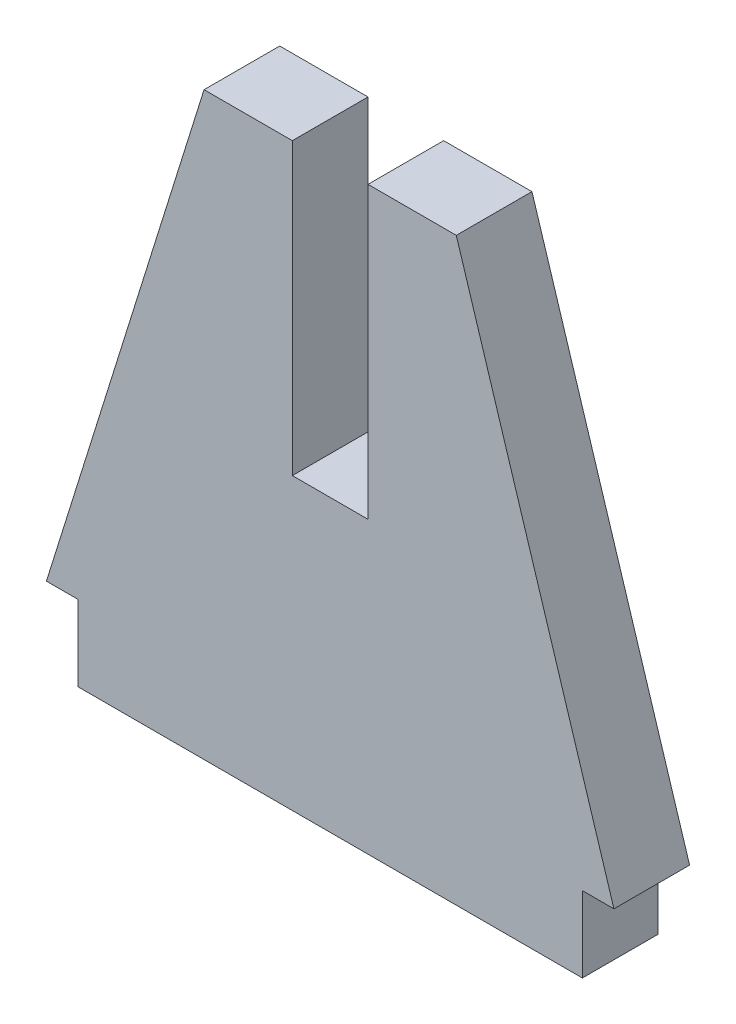
ISO-10303-21;
HEADER;
FILE_DESCRIPTION(('STEP AP214'),'2;1');
FILE_NAME('part.step','',(''),(''),'','','');
FILE_SCHEMA(('AUTOMOTIVE_DESIGN { 1 0 10303 214 1 1 1 1 }'));
ENDSEC;
DATA;
#1=APPLICATION_CONTEXT('core data for automotive mechanical design processes');
#2=APPLICATION_PROTOCOL_DEFINITION('international standard','automotive_design',2000,#1);
#3=PRODUCT_CONTEXT('',#1,'mechanical');
#4=PRODUCT('Part','Part','',(#3));
#5=PRODUCT_RELATED_PRODUCT_CATEGORY('part','',(#4));
#6=PRODUCT_DEFINITION_FORMATION('','',#4);
#7=PRODUCT_DEFINITION_CONTEXT('part definition',#1,'design');
#8=PRODUCT_DEFINITION('design','',#6,#7);
#9=PRODUCT_DEFINITION_SHAPE('','',#8);
#10=(LENGTH_UNIT() NAMED_UNIT(*) SI_UNIT(.MILLI.,.METRE.));
#11=(NAMED_UNIT(*) PLANE_ANGLE_UNIT() SI_UNIT($,.RADIAN.));
#12=(NAMED_UNIT(*) SI_UNIT($,.STERADIAN.) SOLID_ANGLE_UNIT());
#13=UNCERTAINTY_MEASURE_WITH_UNIT(LENGTH_MEASURE(1.E-05),#10,'distance_accuracy_value','');
#14=(GEOMETRIC_REPRESENTATION_CONTEXT(3) GLOBAL_UNCERTAINTY_ASSIGNED_CONTEXT((#13)) GLOBAL_UNIT_ASSIGNED_CONTEXT((#10,
#11,#12)) REPRESENTATION_CONTEXT('',''));
#15=CARTESIAN_POINT('',(0.,0.,0.));
#16=DIRECTION('',(0.,0.,1.));
#17=DIRECTION('',(1.,0.,0.));
#18=AXIS2_PLACEMENT_3D('',#15,#16,#17);
#19=CARTESIAN_POINT('',(10.,46.,3.));
#20=DIRECTION('',(0.,-1.,0.));
#21=DIRECTION('',(0.,0.,-1.));
#22=AXIS2_PLACEMENT_3D('',#19,#20,#21);
#23=PLANE('',#22);
#24=DIRECTION('',(-1.,0.,0.));
#25=VECTOR('',#24,1.);
#26=CARTESIAN_POINT('',(10.,46.,3.));
#27=LINE('',#26,#25);
#28=CARTESIAN_POINT('',(-3.,46.,3.));
#29=VERTEX_POINT('',#28);
#30=CARTESIAN_POINT('',(-10.,46.,3.));
#31=VERTEX_POINT('',#30);
#32=EDGE_CURVE('E214',#29,#31,#27,.T.);
#33=ORIENTED_EDGE('',*,*,#32,.F.);
#34=DIRECTION('',(0.,0.,1.));
#35=VECTOR('',#34,1.);
#36=CARTESIAN_POINT('',(-3.,46.,-3.));
#37=LINE('',#36,#35);
#38=CARTESIAN_POINT('',(-3.,46.,-3.));
#39=VERTEX_POINT('',#38);
#40=EDGE_CURVE('E144',#39,#29,#37,.T.);
#41=ORIENTED_EDGE('',*,*,#40,.F.);
#42=DIRECTION('',(-1.,0.,0.));
#43=VECTOR('',#42,1.);
#44=CARTESIAN_POINT('',(10.,46.,-3.));
#45=LINE('',#44,#43);
#46=CARTESIAN_POINT('',(-10.,46.,-3.));
#47=VERTEX_POINT('',#46);
#48=EDGE_CURVE('E148',#39,#47,#45,.T.);
#49=ORIENTED_EDGE('',*,*,#48,.T.);
#50=DIRECTION('',(0.,0.,-1.));
#51=VECTOR('',#50,1.);
#52=CARTESIAN_POINT('',(-10.,46.,3.));
#53=LINE('',#52,#51);
#54=EDGE_CURVE('E162',#31,#47,#53,.T.);
#55=ORIENTED_EDGE('',*,*,#54,.F.);
#56=EDGE_LOOP('',(#33,#41,#49,#55));
#57=FACE_BOUND('',#56,.T.);
#58=ADVANCED_FACE('F30',(#57),#23,.F.);
#59=CARTESIAN_POINT('',(20.,0.,3.));
#60=DIRECTION('',(-1.,0.,0.));
#61=DIRECTION('',(0.,-1.,0.));
#62=AXIS2_PLACEMENT_3D('',#59,#60,#61);
#63=PLANE('',#62);
#64=DIRECTION('',(0.,1.,0.));
#65=VECTOR('',#64,1.);
#66=CARTESIAN_POINT('',(20.,0.,-3.));
#67=LINE('',#66,#65);
#68=CARTESIAN_POINT('',(20.,0.,-3.));
#69=VERTEX_POINT('',#68);
#70=CARTESIAN_POINT('',(20.,6.00000000000001,-3.));
#71=VERTEX_POINT('',#70);
#72=EDGE_CURVE('E140',#69,#71,#67,.T.);
#73=ORIENTED_EDGE('',*,*,#72,.T.);
#74=DIRECTION('',(0.,0.,-1.));
#75=VECTOR('',#74,1.);
#76=CARTESIAN_POINT('',(20.,6.00000000000001,3.));
#77=LINE('',#76,#75);
#78=CARTESIAN_POINT('',(20.,6.00000000000001,3.));
#79=VERTEX_POINT('',#78);
#80=EDGE_CURVE('E11',#79,#71,#77,.T.);
#81=ORIENTED_EDGE('',*,*,#80,.F.);
#82=DIRECTION('',(0.,1.,0.));
#83=VECTOR('',#82,1.);
#84=CARTESIAN_POINT('',(20.,0.,3.));
#85=LINE('',#84,#83);
#86=CARTESIAN_POINT('',(20.,0.,3.));
#87=VERTEX_POINT('',#86);
#88=EDGE_CURVE('E158',#87,#79,#85,.T.);
#89=ORIENTED_EDGE('',*,*,#88,.F.);
#90=DIRECTION('',(0.,0.,-1.));
#91=VECTOR('',#90,1.);
#92=CARTESIAN_POINT('',(20.,0.,3.));
#93=LINE('',#92,#91);
#94=EDGE_CURVE('E136',#87,#69,#93,.T.);
#95=ORIENTED_EDGE('',*,*,#94,.T.);
#96=EDGE_LOOP('',(#73,#81,#89,#95));
#97=FACE_BOUND('',#96,.T.);
#98=ADVANCED_FACE('F32',(#97),#63,.F.);
#99=CARTESIAN_POINT('',(22.5,6.,3.));
#100=DIRECTION('',(0.,1.,0.));
#101=DIRECTION('',(-1.,0.,0.));
#102=AXIS2_PLACEMENT_3D('',#99,#100,#101);
#103=PLANE('',#102);
#104=DIRECTION('',(1.,0.,0.));
#105=VECTOR('',#104,1.);
#106=CARTESIAN_POINT('',(22.5,6.,-3.));
#107=LINE('',#106,#105);
#108=CARTESIAN_POINT('',(22.5,6.,-3.));
#109=VERTEX_POINT('',#108);
#110=EDGE_CURVE('E143',#71,#109,#107,.T.);
#111=ORIENTED_EDGE('',*,*,#110,.T.);
#112=DIRECTION('',(0.,0.,-1.));
#113=VECTOR('',#112,1.);
#114=CARTESIAN_POINT('',(22.5,6.,3.));
#115=LINE('',#114,#113);
#116=CARTESIAN_POINT('',(22.5,6.,3.));
#117=VERTEX_POINT('',#116);
#118=EDGE_CURVE('E38',#117,#109,#115,.T.);
#119=ORIENTED_EDGE('',*,*,#118,.F.);
#120=DIRECTION('',(1.,0.,0.));
#121=VECTOR('',#120,1.);
#122=CARTESIAN_POINT('',(22.5,6.,3.));
#123=LINE('',#122,#121);
#124=EDGE_CURVE('E95',#79,#117,#123,.T.);
#125=ORIENTED_EDGE('',*,*,#124,.F.);
#126=ORIENTED_EDGE('',*,*,#80,.T.);
#127=EDGE_LOOP('',(#111,#119,#125,#126));
#128=FACE_BOUND('',#127,.T.);
#129=ADVANCED_FACE('F243',(#128),#103,.F.);
#130=CARTESIAN_POINT('',(10.,46.,3.));
#131=DIRECTION('',(-0.95447997803503,-0.298274993135947,0.));
#132=DIRECTION('',(0.298274993135947,-0.95447997803503,0.));
#133=AXIS2_PLACEMENT_3D('',#130,#131,#132);
#134=PLANE('',#133);
#135=DIRECTION('',(-0.298274993135947,0.95447997803503,0.));
#136=VECTOR('',#135,1.);
#137=CARTESIAN_POINT('',(10.,46.,-3.));
#138=LINE('',#137,#136);
#139=CARTESIAN_POINT('',(10.,46.,-3.));
#140=VERTEX_POINT('',#139);
#141=EDGE_CURVE('E146',#109,#140,#138,.T.);
#142=ORIENTED_EDGE('',*,*,#141,.T.);
#143=DIRECTION('',(0.,0.,-1.));
#144=VECTOR('',#143,1.);
#145=CARTESIAN_POINT('',(10.,46.,3.));
#146=LINE('',#145,#144);
#147=CARTESIAN_POINT('',(10.,46.,3.));
#148=VERTEX_POINT('',#147);
#149=EDGE_CURVE('E165',#148,#140,#146,.T.);
#150=ORIENTED_EDGE('',*,*,#149,.F.);
#151=DIRECTION('',(-0.298274993135947,0.95447997803503,0.));
#152=VECTOR('',#151,1.);
#153=CARTESIAN_POINT('',(10.,46.,3.));
#154=LINE('',#153,#152);
#155=EDGE_CURVE('E173',#117,#148,#154,.T.);
#156=ORIENTED_EDGE('',*,*,#155,.F.);
#157=ORIENTED_EDGE('',*,*,#118,.T.);
#158=EDGE_LOOP('',(#142,#150,#156,#157));
#159=FACE_BOUND('',#158,.T.);
#160=ADVANCED_FACE('F171',(#159),#134,.F.);
#161=CARTESIAN_POINT('',(3.,46.,-3.));
#162=VERTEX_POINT('',#161);
#163=EDGE_CURVE('E149',#140,#162,#45,.T.);
#164=ORIENTED_EDGE('',*,*,#163,.T.);
#165=DIRECTION('',(0.,0.,1.));
#166=VECTOR('',#165,1.);
#167=CARTESIAN_POINT('',(3.,46.,-3.));
#168=LINE('',#167,#166);
#169=CARTESIAN_POINT('',(3.,46.,3.));
#170=VERTEX_POINT('',#169);
#171=EDGE_CURVE('E186',#162,#170,#168,.T.);
#172=ORIENTED_EDGE('',*,*,#171,.T.);
#173=EDGE_CURVE('E219',#148,#170,#27,.T.);
#174=ORIENTED_EDGE('',*,*,#173,.F.);
#175=ORIENTED_EDGE('',*,*,#149,.T.);
#176=EDGE_LOOP('',(#164,#172,#174,#175));
#177=FACE_BOUND('',#176,.T.);
#178=ADVANCED_FACE('F183',(#177),#23,.F.);
#179=CARTESIAN_POINT('',(-10.,46.,3.));
#180=DIRECTION('',(0.95447997803503,-0.298274993135947,0.));
#181=DIRECTION('',(0.298274993135947,0.95447997803503,0.));
#182=AXIS2_PLACEMENT_3D('',#179,#180,#181);
#183=PLANE('',#182);
#184=DIRECTION('',(-0.298274993135947,-0.95447997803503,0.));
#185=VECTOR('',#184,1.);
#186=CARTESIAN_POINT('',(-10.,46.,-3.));
#187=LINE('',#186,#185);
#188=CARTESIAN_POINT('',(-22.5,6.,-3.));
#189=VERTEX_POINT('',#188);
#190=EDGE_CURVE('E152',#47,#189,#187,.T.);
#191=ORIENTED_EDGE('',*,*,#190,.T.);
#192=DIRECTION('',(0.,0.,-1.));
#193=VECTOR('',#192,1.);
#194=CARTESIAN_POINT('',(-22.5,6.,3.));
#195=LINE('',#194,#193);
#196=CARTESIAN_POINT('',(-22.5,6.,3.));
#197=VERTEX_POINT('',#196);
#198=EDGE_CURVE('E131',#197,#189,#195,.T.);
#199=ORIENTED_EDGE('',*,*,#198,.F.);
#200=DIRECTION('',(-0.298274993135947,-0.95447997803503,0.));
#201=VECTOR('',#200,1.);
#202=CARTESIAN_POINT('',(-10.,46.,3.));
#203=LINE('',#202,#201);
#204=EDGE_CURVE('E119',#31,#197,#203,.T.);
#205=ORIENTED_EDGE('',*,*,#204,.F.);
#206=ORIENTED_EDGE('',*,*,#54,.T.);
#207=EDGE_LOOP('',(#191,#199,#205,#206));
#208=FACE_BOUND('',#207,.T.);
#209=ADVANCED_FACE('F238',(#208),#183,.F.);
#210=CARTESIAN_POINT('',(-22.5,6.,3.));
#211=DIRECTION('',(0.,1.,0.));
#212=DIRECTION('',(-1.,0.,0.));
#213=AXIS2_PLACEMENT_3D('',#210,#211,#212);
#214=PLANE('',#213);
#215=DIRECTION('',(1.,0.,0.));
#216=VECTOR('',#215,1.);
#217=CARTESIAN_POINT('',(-22.5,6.,-3.));
#218=LINE('',#217,#216);
#219=CARTESIAN_POINT('',(-20.,6.,-3.));
#220=VERTEX_POINT('',#219);
#221=EDGE_CURVE('E128',#189,#220,#218,.T.);
#222=ORIENTED_EDGE('',*,*,#221,.T.);
#223=DIRECTION('',(0.,0.,-1.));
#224=VECTOR('',#223,1.);
#225=CARTESIAN_POINT('',(-20.,6.,3.));
#226=LINE('',#225,#224);
#227=CARTESIAN_POINT('',(-20.,6.,3.));
#228=VERTEX_POINT('',#227);
#229=EDGE_CURVE('E125',#228,#220,#226,.T.);
#230=ORIENTED_EDGE('',*,*,#229,.F.);
#231=DIRECTION('',(1.,0.,0.));
#232=VECTOR('',#231,1.);
#233=CARTESIAN_POINT('',(-22.5,6.,3.));
#234=LINE('',#233,#232);
#235=EDGE_CURVE('E111',#197,#228,#234,.T.);
#236=ORIENTED_EDGE('',*,*,#235,.F.);
#237=ORIENTED_EDGE('',*,*,#198,.T.);
#238=EDGE_LOOP('',(#222,#230,#236,#237));
#239=FACE_BOUND('',#238,.T.);
#240=ADVANCED_FACE('F126',(#239),#214,.F.);
#241=CARTESIAN_POINT('',(-20.,6.,3.));
#242=DIRECTION('',(1.,0.,0.));
#243=DIRECTION('',(0.,1.,0.));
#244=AXIS2_PLACEMENT_3D('',#241,#242,#243);
#245=PLANE('',#244);
#246=DIRECTION('',(0.,-1.,0.));
#247=VECTOR('',#246,1.);
#248=CARTESIAN_POINT('',(-20.,6.,-3.));
#249=LINE('',#248,#247);
#250=CARTESIAN_POINT('',(-20.,0.,-3.));
#251=VERTEX_POINT('',#250);
#252=EDGE_CURVE('E155',#220,#251,#249,.T.);
#253=ORIENTED_EDGE('',*,*,#252,.T.);
#254=DIRECTION('',(0.,0.,-1.));
#255=VECTOR('',#254,1.);
#256=CARTESIAN_POINT('',(-20.,0.,3.));
#257=LINE('',#256,#255);
#258=CARTESIAN_POINT('',(-20.,0.,3.));
#259=VERTEX_POINT('',#258);
#260=EDGE_CURVE('E132',#259,#251,#257,.T.);
#261=ORIENTED_EDGE('',*,*,#260,.F.);
#262=DIRECTION('',(0.,-1.,0.));
#263=VECTOR('',#262,1.);
#264=CARTESIAN_POINT('',(-20.,6.,3.));
#265=LINE('',#264,#263);
#266=EDGE_CURVE('E116',#228,#259,#265,.T.);
#267=ORIENTED_EDGE('',*,*,#266,.F.);
#268=ORIENTED_EDGE('',*,*,#229,.T.);
#269=EDGE_LOOP('',(#253,#261,#267,#268));
#270=FACE_BOUND('',#269,.T.);
#271=ADVANCED_FACE('F134',(#270),#245,.F.);
#272=CARTESIAN_POINT('',(-20.,0.,3.));
#273=DIRECTION('',(0.,1.,0.));
#274=DIRECTION('',(-1.,0.,0.));
#275=AXIS2_PLACEMENT_3D('',#272,#273,#274);
#276=PLANE('',#275);
#277=DIRECTION('',(1.,0.,0.));
#278=VECTOR('',#277,1.);
#279=CARTESIAN_POINT('',(-20.,0.,-3.));
#280=LINE('',#279,#278);
#281=EDGE_CURVE('E87',#251,#69,#280,.T.);
#282=ORIENTED_EDGE('',*,*,#281,.T.);
#283=ORIENTED_EDGE('',*,*,#94,.F.);
#284=DIRECTION('',(1.,0.,0.));
#285=VECTOR('',#284,1.);
#286=CARTESIAN_POINT('',(-20.,0.,3.));
#287=LINE('',#286,#285);
#288=EDGE_CURVE('E54',#259,#87,#287,.T.);
#289=ORIENTED_EDGE('',*,*,#288,.F.);
#290=ORIENTED_EDGE('',*,*,#260,.T.);
#291=EDGE_LOOP('',(#282,#283,#289,#290));
#292=FACE_BOUND('',#291,.T.);
#293=ADVANCED_FACE('F239',(#292),#276,.F.);
#294=CARTESIAN_POINT('',(20.,6.00000000000001,3.));
#295=DIRECTION('',(0.,0.,1.));
#296=DIRECTION('',(1.,0.,0.));
#297=AXIS2_PLACEMENT_3D('',#294,#295,#296);
#298=PLANE('',#297);
#299=DIRECTION('',(0.,-1.,0.));
#300=VECTOR('',#299,1.);
#301=CARTESIAN_POINT('',(-3.,46.,3.));
#302=LINE('',#301,#300);
#303=CARTESIAN_POINT('',(-3.,23.,3.));
#304=VERTEX_POINT('',#303);
#305=EDGE_CURVE('E207',#29,#304,#302,.T.);
#306=ORIENTED_EDGE('',*,*,#305,.F.);
#307=ORIENTED_EDGE('',*,*,#32,.T.);
#308=ORIENTED_EDGE('',*,*,#204,.T.);
#309=ORIENTED_EDGE('',*,*,#235,.T.);
#310=ORIENTED_EDGE('',*,*,#266,.T.);
#311=ORIENTED_EDGE('',*,*,#288,.T.);
#312=ORIENTED_EDGE('',*,*,#88,.T.);
#313=ORIENTED_EDGE('',*,*,#124,.T.);
#314=ORIENTED_EDGE('',*,*,#155,.T.);
#315=ORIENTED_EDGE('',*,*,#173,.T.);
#316=DIRECTION('',(0.,1.,0.));
#317=VECTOR('',#316,1.);
#318=CARTESIAN_POINT('',(3.,46.,3.));
#319=LINE('',#318,#317);
#320=CARTESIAN_POINT('',(3.,23.,3.));
#321=VERTEX_POINT('',#320);
#322=EDGE_CURVE('E201',#321,#170,#319,.T.);
#323=ORIENTED_EDGE('',*,*,#322,.F.);
#324=DIRECTION('',(1.,0.,0.));
#325=VECTOR('',#324,1.);
#326=CARTESIAN_POINT('',(-3.,23.,3.));
#327=LINE('',#326,#325);
#328=EDGE_CURVE('E217',#304,#321,#327,.T.);
#329=ORIENTED_EDGE('',*,*,#328,.F.);
#330=EDGE_LOOP('',(#306,#307,#308,#309,#310,#311,#312,#313,#314,#315,#323,#329));
#331=FACE_BOUND('',#330,.T.);
#332=ADVANCED_FACE('F114',(#331),#298,.T.);
#333=CARTESIAN_POINT('',(20.,6.00000000000001,-3.));
#334=DIRECTION('',(0.,0.,1.));
#335=DIRECTION('',(1.,0.,0.));
#336=AXIS2_PLACEMENT_3D('',#333,#334,#335);
#337=PLANE('',#336);
#338=ORIENTED_EDGE('',*,*,#48,.F.);
#339=DIRECTION('',(0.,-1.,0.));
#340=VECTOR('',#339,1.);
#341=CARTESIAN_POINT('',(-3.,46.,-3.));
#342=LINE('',#341,#340);
#343=CARTESIAN_POINT('',(-3.,23.,-3.));
#344=VERTEX_POINT('',#343);
#345=EDGE_CURVE('E210',#39,#344,#342,.T.);
#346=ORIENTED_EDGE('',*,*,#345,.T.);
#347=DIRECTION('',(1.,0.,0.));
#348=VECTOR('',#347,1.);
#349=CARTESIAN_POINT('',(-3.,23.,-3.));
#350=LINE('',#349,#348);
#351=CARTESIAN_POINT('',(3.,23.,-3.));
#352=VERTEX_POINT('',#351);
#353=EDGE_CURVE('E233',#344,#352,#350,.T.);
#354=ORIENTED_EDGE('',*,*,#353,.T.);
#355=DIRECTION('',(0.,1.,0.));
#356=VECTOR('',#355,1.);
#357=CARTESIAN_POINT('',(3.,46.,-3.));
#358=LINE('',#357,#356);
#359=EDGE_CURVE('E45',#352,#162,#358,.T.);
#360=ORIENTED_EDGE('',*,*,#359,.T.);
#361=ORIENTED_EDGE('',*,*,#163,.F.);
#362=ORIENTED_EDGE('',*,*,#141,.F.);
#363=ORIENTED_EDGE('',*,*,#110,.F.);
#364=ORIENTED_EDGE('',*,*,#72,.F.);
#365=ORIENTED_EDGE('',*,*,#281,.F.);
#366=ORIENTED_EDGE('',*,*,#252,.F.);
#367=ORIENTED_EDGE('',*,*,#221,.F.);
#368=ORIENTED_EDGE('',*,*,#190,.F.);
#369=EDGE_LOOP('',(#338,#346,#354,#360,#361,#362,#363,#364,#365,#366,#367,#368));
#370=FACE_BOUND('',#369,.T.);
#371=ADVANCED_FACE('F177',(#370),#337,.F.);
#372=CARTESIAN_POINT('',(-3.,46.,-3.));
#373=DIRECTION('',(-1.,0.,0.));
#374=DIRECTION('',(0.,0.,1.));
#375=AXIS2_PLACEMENT_3D('',#372,#373,#374);
#376=PLANE('',#375);
#377=ORIENTED_EDGE('',*,*,#305,.T.);
#378=DIRECTION('',(0.,0.,1.));
#379=VECTOR('',#378,1.);
#380=CARTESIAN_POINT('',(-3.,23.,-3.));
#381=LINE('',#380,#379);
#382=EDGE_CURVE('E225',#344,#304,#381,.T.);
#383=ORIENTED_EDGE('',*,*,#382,.F.);
#384=ORIENTED_EDGE('',*,*,#345,.F.);
#385=ORIENTED_EDGE('',*,*,#40,.T.);
#386=EDGE_LOOP('',(#377,#383,#384,#385));
#387=FACE_BOUND('',#386,.T.);
#388=ADVANCED_FACE('F206',(#387),#376,.F.);
#389=CARTESIAN_POINT('',(3.,46.,-3.));
#390=DIRECTION('',(1.,0.,0.));
#391=DIRECTION('',(0.,0.,-1.));
#392=AXIS2_PLACEMENT_3D('',#389,#390,#391);
#393=PLANE('',#392);
#394=ORIENTED_EDGE('',*,*,#322,.T.);
#395=ORIENTED_EDGE('',*,*,#171,.F.);
#396=ORIENTED_EDGE('',*,*,#359,.F.);
#397=DIRECTION('',(0.,0.,1.));
#398=VECTOR('',#397,1.);
#399=CARTESIAN_POINT('',(3.,23.,-3.));
#400=LINE('',#399,#398);
#401=EDGE_CURVE('E227',#352,#321,#400,.T.);
#402=ORIENTED_EDGE('',*,*,#401,.T.);
#403=EDGE_LOOP('',(#394,#395,#396,#402));
#404=FACE_BOUND('',#403,.T.);
#405=ADVANCED_FACE('F274',(#404),#393,.F.);
#406=CARTESIAN_POINT('',(-3.,23.,-3.));
#407=DIRECTION('',(0.,-1.,0.));
#408=DIRECTION('',(0.,0.,-1.));
#409=AXIS2_PLACEMENT_3D('',#406,#407,#408);
#410=PLANE('',#409);
#411=ORIENTED_EDGE('',*,*,#328,.T.);
#412=ORIENTED_EDGE('',*,*,#401,.F.);
#413=ORIENTED_EDGE('',*,*,#353,.F.);
#414=ORIENTED_EDGE('',*,*,#382,.T.);
#415=EDGE_LOOP('',(#411,#412,#413,#414));
#416=FACE_BOUND('',#415,.T.);
#417=ADVANCED_FACE('F275',(#416),#410,.F.);
#418=CLOSED_SHELL('',(#58,#98,#129,#160,#178,#209,#240,#271,#293,#332,#371,#388,#405,#417));
#419=MANIFOLD_SOLID_BREP('B2',#418);
#420=ADVANCED_BREP_SHAPE_REPRESENTATION('',(#18,#419),#14);
#421=SHAPE_DEFINITION_REPRESENTATION(#9,#420);
ENDSEC;
END-ISO-10303-21;
